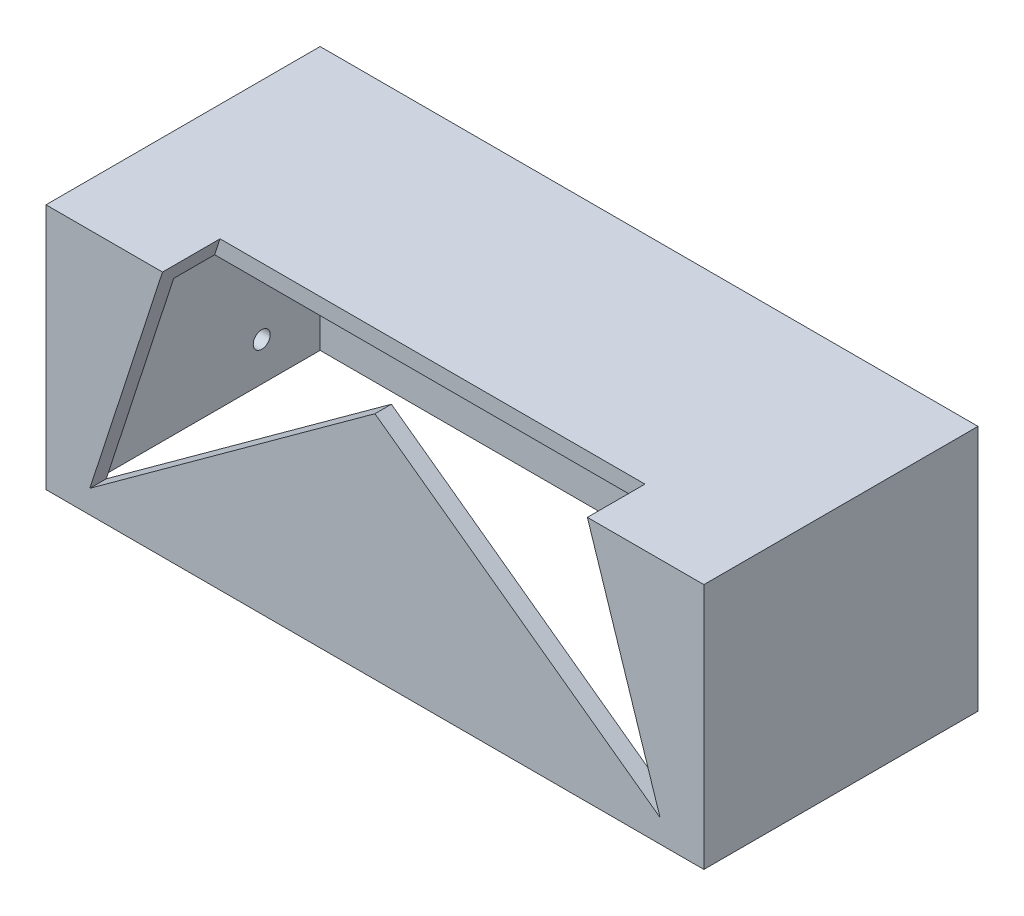
ISO-10303-21;
HEADER;
FILE_DESCRIPTION(('STEP AP214'),'2;1');
FILE_NAME('part.step','',(''),(''),'','','');
FILE_SCHEMA(('AUTOMOTIVE_DESIGN { 1 0 10303 214 1 1 1 1 }'));
ENDSEC;
DATA;
#1=APPLICATION_CONTEXT('core data for automotive mechanical design processes');
#2=APPLICATION_PROTOCOL_DEFINITION('international standard','automotive_design',2000,#1);
#3=PRODUCT_CONTEXT('',#1,'mechanical');
#4=PRODUCT('Part','Part','',(#3));
#5=PRODUCT_RELATED_PRODUCT_CATEGORY('part','',(#4));
#6=PRODUCT_DEFINITION_FORMATION('','',#4);
#7=PRODUCT_DEFINITION_CONTEXT('part definition',#1,'design');
#8=PRODUCT_DEFINITION('design','',#6,#7);
#9=PRODUCT_DEFINITION_SHAPE('','',#8);
#10=(LENGTH_UNIT() NAMED_UNIT(*) SI_UNIT(.MILLI.,.METRE.));
#11=(NAMED_UNIT(*) PLANE_ANGLE_UNIT() SI_UNIT($,.RADIAN.));
#12=(NAMED_UNIT(*) SI_UNIT($,.STERADIAN.) SOLID_ANGLE_UNIT());
#13=UNCERTAINTY_MEASURE_WITH_UNIT(LENGTH_MEASURE(1.E-05),#10,'distance_accuracy_value','');
#14=(GEOMETRIC_REPRESENTATION_CONTEXT(3) GLOBAL_UNCERTAINTY_ASSIGNED_CONTEXT((#13)) GLOBAL_UNIT_ASSIGNED_CONTEXT((#10,
#11,#12)) REPRESENTATION_CONTEXT('',''));
#15=CARTESIAN_POINT('',(0.,0.,0.));
#16=DIRECTION('',(0.,0.,1.));
#17=DIRECTION('',(1.,0.,0.));
#18=AXIS2_PLACEMENT_3D('',#15,#16,#17);
#19=CARTESIAN_POINT('',(-60.,-75.7889870078079,-7.00000000000001));
#20=DIRECTION('',(0.,1.,0.));
#21=DIRECTION('',(0.,0.,1.));
#22=AXIS2_PLACEMENT_3D('',#19,#20,#21);
#23=PLANE('',#22);
#24=DIRECTION('',(0.,0.,-1.));
#25=VECTOR('',#24,1.);
#26=CARTESIAN_POINT('',(-60.,-75.7889870078079,-7.00000000000001));
#27=LINE('',#26,#25);
#28=CARTESIAN_POINT('',(-60.,-75.7889870078079,-7.00000000000001));
#29=VERTEX_POINT('',#28);
#30=CARTESIAN_POINT('',(-60.,-75.7889870078079,-57.));
#31=VERTEX_POINT('',#30);
#32=EDGE_CURVE('E427',#29,#31,#27,.T.);
#33=ORIENTED_EDGE('',*,*,#32,.T.);
#34=DIRECTION('',(1.,0.,0.));
#35=VECTOR('',#34,1.);
#36=CARTESIAN_POINT('',(-60.,-75.7889870078079,-57.));
#37=LINE('',#36,#35);
#38=CARTESIAN_POINT('',(60.,-75.7889870078079,-57.));
#39=VERTEX_POINT('',#38);
#40=EDGE_CURVE('E315',#31,#39,#37,.T.);
#41=ORIENTED_EDGE('',*,*,#40,.T.);
#42=DIRECTION('',(0.,0.,-1.));
#43=VECTOR('',#42,1.);
#44=CARTESIAN_POINT('',(60.,-75.7889870078079,-7.00000000000001));
#45=LINE('',#44,#43);
#46=CARTESIAN_POINT('',(60.,-75.7889870078079,-7.00000000000001));
#47=VERTEX_POINT('',#46);
#48=EDGE_CURVE('E424',#47,#39,#45,.T.);
#49=ORIENTED_EDGE('',*,*,#48,.F.);
#50=DIRECTION('',(1.,0.,0.));
#51=VECTOR('',#50,1.);
#52=CARTESIAN_POINT('',(-60.,-75.7889870078079,-7.00000000000001));
#53=LINE('',#52,#51);
#54=EDGE_CURVE('E440',#29,#47,#53,.T.);
#55=ORIENTED_EDGE('',*,*,#54,.F.);
#56=EDGE_LOOP('',(#33,#41,#49,#55));
#57=FACE_BOUND('',#56,.T.);
#58=DIRECTION('',(0.,0.,-1.));
#59=VECTOR('',#58,1.);
#60=CARTESIAN_POINT('',(-57.,-75.7889870078079,-7.00000000000001));
#61=LINE('',#60,#59);
#62=CARTESIAN_POINT('',(-57.,-75.7889870078079,-10.));
#63=VERTEX_POINT('',#62);
#64=CARTESIAN_POINT('',(-57.,-75.7889870078079,-54.));
#65=VERTEX_POINT('',#64);
#66=EDGE_CURVE('E390',#63,#65,#61,.T.);
#67=ORIENTED_EDGE('',*,*,#66,.F.);
#68=DIRECTION('',(1.,0.,0.));
#69=VECTOR('',#68,1.);
#70=CARTESIAN_POINT('',(0.,-75.7889870078079,-10.));
#71=LINE('',#70,#69);
#72=CARTESIAN_POINT('',(57.,-75.7889870078079,-10.));
#73=VERTEX_POINT('',#72);
#74=EDGE_CURVE('E386',#63,#73,#71,.T.);
#75=ORIENTED_EDGE('',*,*,#74,.T.);
#76=DIRECTION('',(0.,0.,-1.));
#77=VECTOR('',#76,1.);
#78=CARTESIAN_POINT('',(57.,-75.7889870078079,-7.00000000000001));
#79=LINE('',#78,#77);
#80=CARTESIAN_POINT('',(57.,-75.7889870078079,-54.));
#81=VERTEX_POINT('',#80);
#82=EDGE_CURVE('E387',#73,#81,#79,.T.);
#83=ORIENTED_EDGE('',*,*,#82,.T.);
#84=DIRECTION('',(1.,0.,0.));
#85=VECTOR('',#84,1.);
#86=CARTESIAN_POINT('',(0.,-75.7889870078079,-54.));
#87=LINE('',#86,#85);
#88=EDGE_CURVE('E375',#65,#81,#87,.T.);
#89=ORIENTED_EDGE('',*,*,#88,.F.);
#90=EDGE_LOOP('',(#67,#75,#83,#89));
#91=FACE_BOUND('',#90,.T.);
#92=ADVANCED_FACE('F39',(#57,#91),#23,.F.);
#93=CARTESIAN_POINT('',(60.,-75.7889870078079,-7.00000000000001));
#94=DIRECTION('',(-1.,0.,0.));
#95=DIRECTION('',(0.,0.,1.));
#96=AXIS2_PLACEMENT_3D('',#93,#94,#95);
#97=PLANE('',#96);
#98=ORIENTED_EDGE('',*,*,#48,.T.);
#99=DIRECTION('',(0.,1.,0.));
#100=VECTOR('',#99,1.);
#101=CARTESIAN_POINT('',(60.,-75.7889870078079,-57.));
#102=LINE('',#101,#100);
#103=CARTESIAN_POINT('',(60.,-30.7889870078079,-57.));
#104=VERTEX_POINT('',#103);
#105=EDGE_CURVE('E396',#39,#104,#102,.T.);
#106=ORIENTED_EDGE('',*,*,#105,.T.);
#107=DIRECTION('',(0.,0.,-1.));
#108=VECTOR('',#107,1.);
#109=CARTESIAN_POINT('',(60.,-30.7889870078079,-7.00000000000001));
#110=LINE('',#109,#108);
#111=CARTESIAN_POINT('',(60.,-30.7889870078079,-7.00000000000001));
#112=VERTEX_POINT('',#111);
#113=EDGE_CURVE('E333',#112,#104,#110,.T.);
#114=ORIENTED_EDGE('',*,*,#113,.F.);
#115=DIRECTION('',(0.,1.,0.));
#116=VECTOR('',#115,1.);
#117=CARTESIAN_POINT('',(60.,-75.7889870078079,-7.00000000000001));
#118=LINE('',#117,#116);
#119=EDGE_CURVE('E307',#47,#112,#118,.T.);
#120=ORIENTED_EDGE('',*,*,#119,.F.);
#121=EDGE_LOOP('',(#98,#106,#114,#120));
#122=FACE_BOUND('',#121,.T.);
#123=ADVANCED_FACE('F41',(#122),#97,.F.);
#124=CARTESIAN_POINT('',(-60.,-30.7889870078079,-7.00000000000001));
#125=DIRECTION('',(0.,-1.,0.));
#126=DIRECTION('',(0.,0.,-1.));
#127=AXIS2_PLACEMENT_3D('',#124,#125,#126);
#128=PLANE('',#127);
#129=DIRECTION('',(-1.,0.,0.));
#130=VECTOR('',#129,1.);
#131=CARTESIAN_POINT('',(-60.,-30.7889870078079,-7.00000000000001));
#132=LINE('',#131,#130);
#133=CARTESIAN_POINT('',(-38.7498603935466,-30.7889870078079,-7.00000000000001));
#134=VERTEX_POINT('',#133);
#135=CARTESIAN_POINT('',(-60.,-30.7889870078079,-7.00000000000001));
#136=VERTEX_POINT('',#135);
#137=EDGE_CURVE('E297',#134,#136,#132,.T.);
#138=ORIENTED_EDGE('',*,*,#137,.F.);
#139=DIRECTION('',(0.,0.,-1.));
#140=VECTOR('',#139,1.);
#141=CARTESIAN_POINT('',(-38.7498603935466,-30.7889870078079,-7.00000000000001));
#142=LINE('',#141,#140);
#143=CARTESIAN_POINT('',(-38.7498603935466,-30.7889870078079,-17.5));
#144=VERTEX_POINT('',#143);
#145=EDGE_CURVE('E299',#134,#144,#142,.T.);
#146=ORIENTED_EDGE('',*,*,#145,.T.);
#147=DIRECTION('',(1.,0.,0.));
#148=VECTOR('',#147,1.);
#149=CARTESIAN_POINT('',(-60.,-30.7889870078079,-17.5));
#150=LINE('',#149,#148);
#151=CARTESIAN_POINT('',(38.7498603935466,-30.7889870078079,-17.5));
#152=VERTEX_POINT('',#151);
#153=EDGE_CURVE('E470',#144,#152,#150,.T.);
#154=ORIENTED_EDGE('',*,*,#153,.T.);
#155=DIRECTION('',(0.,0.,1.));
#156=VECTOR('',#155,1.);
#157=CARTESIAN_POINT('',(38.7498603935466,-30.7889870078079,-7.00000000000001));
#158=LINE('',#157,#156);
#159=CARTESIAN_POINT('',(38.7498603935466,-30.7889870078079,-7.00000000000001));
#160=VERTEX_POINT('',#159);
#161=EDGE_CURVE('E364',#152,#160,#158,.T.);
#162=ORIENTED_EDGE('',*,*,#161,.T.);
#163=EDGE_CURVE('E306',#112,#160,#132,.T.);
#164=ORIENTED_EDGE('',*,*,#163,.F.);
#165=ORIENTED_EDGE('',*,*,#113,.T.);
#166=DIRECTION('',(-1.,0.,0.));
#167=VECTOR('',#166,1.);
#168=CARTESIAN_POINT('',(-60.,-30.7889870078079,-57.));
#169=LINE('',#168,#167);
#170=CARTESIAN_POINT('',(-60.,-30.7889870078079,-57.));
#171=VERTEX_POINT('',#170);
#172=EDGE_CURVE('E400',#104,#171,#169,.T.);
#173=ORIENTED_EDGE('',*,*,#172,.T.);
#174=DIRECTION('',(0.,0.,-1.));
#175=VECTOR('',#174,1.);
#176=CARTESIAN_POINT('',(-60.,-30.7889870078079,-7.00000000000001));
#177=LINE('',#176,#175);
#178=EDGE_CURVE('E301',#136,#171,#177,.T.);
#179=ORIENTED_EDGE('',*,*,#178,.F.);
#180=EDGE_LOOP('',(#138,#146,#154,#162,#164,#165,#173,#179));
#181=FACE_BOUND('',#180,.T.);
#182=ADVANCED_FACE('F280',(#181),#128,.F.);
#183=CARTESIAN_POINT('',(-60.,-75.7889870078079,-7.00000000000001));
#184=DIRECTION('',(1.,0.,0.));
#185=DIRECTION('',(0.,0.,-1.));
#186=AXIS2_PLACEMENT_3D('',#183,#184,#185);
#187=PLANE('',#186);
#188=CARTESIAN_POINT('',(-60.,-37.7715931653233,-43.35));
#189=DIRECTION('',(-1.,0.,0.));
#190=DIRECTION('',(0.,0.,1.));
#191=AXIS2_PLACEMENT_3D('',#188,#189,#190);
#192=CIRCLE('',#191,1.55000000000001);
#193=CARTESIAN_POINT('',(-60.,-37.7715931653233,-41.8));
#194=VERTEX_POINT('',#193);
#195=EDGE_CURVE('E240',#194,#194,#192,.T.);
#196=ORIENTED_EDGE('',*,*,#195,.F.);
#197=EDGE_LOOP('',(#196));
#198=FACE_BOUND('',#197,.T.);
#199=CARTESIAN_POINT('',(-60.,-68.7368054803541,-43.35));
#200=DIRECTION('',(-1.,0.,0.));
#201=DIRECTION('',(0.,0.,1.));
#202=AXIS2_PLACEMENT_3D('',#199,#200,#201);
#203=CIRCLE('',#202,1.55000000000001);
#204=CARTESIAN_POINT('',(-60.,-68.7368054803541,-41.8));
#205=VERTEX_POINT('',#204);
#206=EDGE_CURVE('E249',#205,#205,#203,.T.);
#207=ORIENTED_EDGE('',*,*,#206,.F.);
#208=EDGE_LOOP('',(#207));
#209=FACE_BOUND('',#208,.T.);
#210=DIRECTION('',(0.,1.,0.));
#211=VECTOR('',#210,1.);
#212=CARTESIAN_POINT('',(-60.,-58.5041993228387,-44.5));
#213=LINE('',#212,#211);
#214=CARTESIAN_POINT('',(-60.,-58.5041993228387,-44.5));
#215=VERTEX_POINT('',#214);
#216=CARTESIAN_POINT('',(-60.,-48.0041993228387,-44.5));
#217=VERTEX_POINT('',#216);
#218=EDGE_CURVE('E184',#215,#217,#213,.T.);
#219=ORIENTED_EDGE('',*,*,#218,.F.);
#220=DIRECTION('',(0.,0.,1.));
#221=VECTOR('',#220,1.);
#222=CARTESIAN_POINT('',(-60.,-58.5041993228387,-52.5));
#223=LINE('',#222,#221);
#224=CARTESIAN_POINT('',(-60.,-58.5041993228387,-52.5));
#225=VERTEX_POINT('',#224);
#226=EDGE_CURVE('E205',#225,#215,#223,.T.);
#227=ORIENTED_EDGE('',*,*,#226,.F.);
#228=DIRECTION('',(0.,-1.,0.));
#229=VECTOR('',#228,1.);
#230=CARTESIAN_POINT('',(-60.,-58.5041993228387,-52.5));
#231=LINE('',#230,#229);
#232=CARTESIAN_POINT('',(-60.,-48.0041993228387,-52.5));
#233=VERTEX_POINT('',#232);
#234=EDGE_CURVE('E201',#233,#225,#231,.T.);
#235=ORIENTED_EDGE('',*,*,#234,.F.);
#236=DIRECTION('',(0.,0.,-1.));
#237=VECTOR('',#236,1.);
#238=CARTESIAN_POINT('',(-60.,-48.0041993228387,-52.5));
#239=LINE('',#238,#237);
#240=EDGE_CURVE('E54',#217,#233,#239,.T.);
#241=ORIENTED_EDGE('',*,*,#240,.F.);
#242=EDGE_LOOP('',(#219,#227,#235,#241));
#243=FACE_BOUND('',#242,.T.);
#244=ORIENTED_EDGE('',*,*,#178,.T.);
#245=DIRECTION('',(0.,-1.,0.));
#246=VECTOR('',#245,1.);
#247=CARTESIAN_POINT('',(-60.,-75.7889870078079,-57.));
#248=LINE('',#247,#246);
#249=EDGE_CURVE('E430',#171,#31,#248,.T.);
#250=ORIENTED_EDGE('',*,*,#249,.T.);
#251=ORIENTED_EDGE('',*,*,#32,.F.);
#252=DIRECTION('',(0.,-1.,0.));
#253=VECTOR('',#252,1.);
#254=CARTESIAN_POINT('',(-60.,-75.7889870078079,-7.00000000000001));
#255=LINE('',#254,#253);
#256=EDGE_CURVE('E312',#136,#29,#255,.T.);
#257=ORIENTED_EDGE('',*,*,#256,.F.);
#258=EDGE_LOOP('',(#244,#250,#251,#257));
#259=FACE_BOUND('',#258,.T.);
#260=ADVANCED_FACE('F287',(#198,#209,#243,#259),#187,.F.);
#261=CARTESIAN_POINT('',(0.,0.,-7.00000000000001));
#262=DIRECTION('',(0.,0.,-1.));
#263=DIRECTION('',(-1.,0.,0.));
#264=AXIS2_PLACEMENT_3D('',#261,#262,#263);
#265=PLANE('',#264);
#266=DIRECTION('',(0.809016994374948,0.587785252292473,0.));
#267=VECTOR('',#266,1.);
#268=CARTESIAN_POINT('',(-52.0018434853685,-71.5743972044329,-7.00000000000001));
#269=LINE('',#268,#267);
#270=CARTESIAN_POINT('',(-52.0018434853685,-71.5743972044329,-7.00000000000001));
#271=VERTEX_POINT('',#270);
#272=CARTESIAN_POINT('',(0.,-33.7928463776342,-7.00000000000001));
#273=VERTEX_POINT('',#272);
#274=EDGE_CURVE('E452',#271,#273,#269,.T.);
#275=ORIENTED_EDGE('',*,*,#274,.F.);
#276=DIRECTION('',(-0.309016994374947,-0.951056516295154,0.));
#277=VECTOR('',#276,1.);
#278=CARTESIAN_POINT('',(-32.13890675161,-10.4425638189908,-7.00000000000001));
#279=LINE('',#278,#277);
#280=EDGE_CURVE('E245',#134,#271,#279,.T.);
#281=ORIENTED_EDGE('',*,*,#280,.F.);
#282=ORIENTED_EDGE('',*,*,#137,.T.);
#283=ORIENTED_EDGE('',*,*,#256,.T.);
#284=ORIENTED_EDGE('',*,*,#54,.T.);
#285=ORIENTED_EDGE('',*,*,#119,.T.);
#286=ORIENTED_EDGE('',*,*,#163,.T.);
#287=DIRECTION('',(-0.309016994374947,0.951056516295154,0.));
#288=VECTOR('',#287,1.);
#289=CARTESIAN_POINT('',(52.0018434853685,-71.5743972044329,-7.00000000000001));
#290=LINE('',#289,#288);
#291=CARTESIAN_POINT('',(52.0018434853685,-71.5743972044329,-7.00000000000001));
#292=VERTEX_POINT('',#291);
#293=EDGE_CURVE('E224',#292,#160,#290,.T.);
#294=ORIENTED_EDGE('',*,*,#293,.F.);
#295=DIRECTION('',(0.809016994374947,-0.587785252292473,0.));
#296=VECTOR('',#295,1.);
#297=CARTESIAN_POINT('',(0.,-33.7928463776342,-7.00000000000001));
#298=LINE('',#297,#296);
#299=EDGE_CURVE('E229',#273,#292,#298,.T.);
#300=ORIENTED_EDGE('',*,*,#299,.F.);
#301=EDGE_LOOP('',(#275,#281,#282,#283,#284,#285,#286,#294,#300));
#302=FACE_BOUND('',#301,.T.);
#303=ADVANCED_FACE('F285',(#302),#265,.F.);
#304=CARTESIAN_POINT('',(0.,0.,-57.));
#305=DIRECTION('',(0.,0.,-1.));
#306=DIRECTION('',(-1.,0.,0.));
#307=AXIS2_PLACEMENT_3D('',#304,#305,#306);
#308=PLANE('',#307);
#309=CARTESIAN_POINT('',(-7.61739384248457,-53.2541993228387,-57.));
#310=DIRECTION('',(0.,0.,-1.));
#311=DIRECTION('',(-1.,0.,0.));
#312=AXIS2_PLACEMENT_3D('',#309,#310,#311);
#313=CIRCLE('',#312,1.54999999999999);
#314=CARTESIAN_POINT('',(-9.16739384248456,-53.2541993228387,-57.));
#315=VERTEX_POINT('',#314);
#316=EDGE_CURVE('E194',#315,#315,#313,.T.);
#317=ORIENTED_EDGE('',*,*,#316,.F.);
#318=EDGE_LOOP('',(#317));
#319=FACE_BOUND('',#318,.T.);
#320=ORIENTED_EDGE('',*,*,#105,.F.);
#321=ORIENTED_EDGE('',*,*,#40,.F.);
#322=ORIENTED_EDGE('',*,*,#249,.F.);
#323=ORIENTED_EDGE('',*,*,#172,.F.);
#324=EDGE_LOOP('',(#320,#321,#322,#323));
#325=FACE_BOUND('',#324,.T.);
#326=ADVANCED_FACE('F412',(#319,#325),#308,.T.);
#327=CARTESIAN_POINT('',(57.,-75.7889870078079,-7.00000000000001));
#328=DIRECTION('',(-1.,0.,0.));
#329=DIRECTION('',(0.,0.,1.));
#330=AXIS2_PLACEMENT_3D('',#327,#328,#329);
#331=PLANE('',#330);
#332=ORIENTED_EDGE('',*,*,#82,.F.);
#333=DIRECTION('',(0.,1.,0.));
#334=VECTOR('',#333,1.);
#335=CARTESIAN_POINT('',(57.,0.,-10.));
#336=LINE('',#335,#334);
#337=CARTESIAN_POINT('',(57.,-33.7889870078079,-10.));
#338=VERTEX_POINT('',#337);
#339=EDGE_CURVE('E371',#73,#338,#336,.T.);
#340=ORIENTED_EDGE('',*,*,#339,.T.);
#341=DIRECTION('',(0.,0.,-1.));
#342=VECTOR('',#341,1.);
#343=CARTESIAN_POINT('',(57.,-33.7889870078079,-7.00000000000001));
#344=LINE('',#343,#342);
#345=CARTESIAN_POINT('',(57.,-33.7889870078079,-54.));
#346=VERTEX_POINT('',#345);
#347=EDGE_CURVE('E401',#338,#346,#344,.T.);
#348=ORIENTED_EDGE('',*,*,#347,.T.);
#349=DIRECTION('',(0.,1.,0.));
#350=VECTOR('',#349,1.);
#351=CARTESIAN_POINT('',(57.,0.,-54.));
#352=LINE('',#351,#350);
#353=EDGE_CURVE('E474',#81,#346,#352,.T.);
#354=ORIENTED_EDGE('',*,*,#353,.F.);
#355=EDGE_LOOP('',(#332,#340,#348,#354));
#356=FACE_BOUND('',#355,.T.);
#357=ADVANCED_FACE('F415',(#356),#331,.T.);
#358=CARTESIAN_POINT('',(-60.,-33.7889870078079,-7.00000000000001));
#359=DIRECTION('',(0.,-1.,0.));
#360=DIRECTION('',(0.,0.,-1.));
#361=AXIS2_PLACEMENT_3D('',#358,#359,#360);
#362=PLANE('',#361);
#363=DIRECTION('',(0.,0.,-1.));
#364=VECTOR('',#363,1.);
#365=CARTESIAN_POINT('',(-39.7246194822454,-33.7889870078079,-7.00000000000001));
#366=LINE('',#365,#364);
#367=CARTESIAN_POINT('',(-39.7246194822454,-33.7889870078079,-10.));
#368=VERTEX_POINT('',#367);
#369=CARTESIAN_POINT('',(-39.7246194822454,-33.7889870078079,-17.5));
#370=VERTEX_POINT('',#369);
#371=EDGE_CURVE('E351',#368,#370,#366,.T.);
#372=ORIENTED_EDGE('',*,*,#371,.F.);
#373=DIRECTION('',(-1.,0.,0.));
#374=VECTOR('',#373,1.);
#375=CARTESIAN_POINT('',(0.,-33.7889870078079,-10.));
#376=LINE('',#375,#374);
#377=CARTESIAN_POINT('',(-57.,-33.7889870078079,-10.));
#378=VERTEX_POINT('',#377);
#379=EDGE_CURVE('E361',#368,#378,#376,.T.);
#380=ORIENTED_EDGE('',*,*,#379,.T.);
#381=DIRECTION('',(0.,0.,-1.));
#382=VECTOR('',#381,1.);
#383=CARTESIAN_POINT('',(-57.,-33.7889870078079,-7.00000000000001));
#384=LINE('',#383,#382);
#385=CARTESIAN_POINT('',(-57.,-33.7889870078079,-54.));
#386=VERTEX_POINT('',#385);
#387=EDGE_CURVE('E379',#378,#386,#384,.T.);
#388=ORIENTED_EDGE('',*,*,#387,.T.);
#389=DIRECTION('',(-1.,0.,0.));
#390=VECTOR('',#389,1.);
#391=CARTESIAN_POINT('',(0.,-33.7889870078079,-54.));
#392=LINE('',#391,#390);
#393=EDGE_CURVE('E384',#346,#386,#392,.T.);
#394=ORIENTED_EDGE('',*,*,#393,.F.);
#395=ORIENTED_EDGE('',*,*,#347,.F.);
#396=CARTESIAN_POINT('',(39.7246194822454,-33.7889870078079,-10.));
#397=VERTEX_POINT('',#396);
#398=EDGE_CURVE('E370',#338,#397,#376,.T.);
#399=ORIENTED_EDGE('',*,*,#398,.T.);
#400=DIRECTION('',(0.,0.,1.));
#401=VECTOR('',#400,1.);
#402=CARTESIAN_POINT('',(39.7246194822454,-33.7889870078079,-7.00000000000001));
#403=LINE('',#402,#401);
#404=CARTESIAN_POINT('',(39.7246194822454,-33.7889870078079,-17.5));
#405=VERTEX_POINT('',#404);
#406=EDGE_CURVE('E457',#405,#397,#403,.T.);
#407=ORIENTED_EDGE('',*,*,#406,.F.);
#408=DIRECTION('',(1.,0.,0.));
#409=VECTOR('',#408,1.);
#410=CARTESIAN_POINT('',(-60.,-33.7889870078079,-17.5));
#411=LINE('',#410,#409);
#412=EDGE_CURVE('E12',#370,#405,#411,.T.);
#413=ORIENTED_EDGE('',*,*,#412,.F.);
#414=EDGE_LOOP('',(#372,#380,#388,#394,#395,#399,#407,#413));
#415=FACE_BOUND('',#414,.T.);
#416=ADVANCED_FACE('F360',(#415),#362,.T.);
#417=CARTESIAN_POINT('',(-57.,-75.7889870078079,-7.00000000000001));
#418=DIRECTION('',(1.,0.,0.));
#419=DIRECTION('',(0.,0.,-1.));
#420=AXIS2_PLACEMENT_3D('',#417,#418,#419);
#421=PLANE('',#420);
#422=CARTESIAN_POINT('',(-57.,-37.7715931653233,-43.35));
#423=DIRECTION('',(1.,0.,0.));
#424=DIRECTION('',(0.,0.,-1.));
#425=AXIS2_PLACEMENT_3D('',#422,#423,#424);
#426=CIRCLE('',#425,1.55000000000001);
#427=CARTESIAN_POINT('',(-57.,-37.7715931653233,-44.9));
#428=VERTEX_POINT('',#427);
#429=EDGE_CURVE('E246',#428,#428,#426,.F.);
#430=ORIENTED_EDGE('',*,*,#429,.T.);
#431=EDGE_LOOP('',(#430));
#432=FACE_BOUND('',#431,.T.);
#433=CARTESIAN_POINT('',(-57.,-68.7368054803541,-43.35));
#434=DIRECTION('',(1.,0.,0.));
#435=DIRECTION('',(0.,0.,-1.));
#436=AXIS2_PLACEMENT_3D('',#433,#434,#435);
#437=CIRCLE('',#436,1.55000000000001);
#438=CARTESIAN_POINT('',(-57.,-68.7368054803541,-44.9));
#439=VERTEX_POINT('',#438);
#440=EDGE_CURVE('E197',#439,#439,#437,.F.);
#441=ORIENTED_EDGE('',*,*,#440,.T.);
#442=EDGE_LOOP('',(#441));
#443=FACE_BOUND('',#442,.T.);
#444=DIRECTION('',(0.,0.,1.));
#445=VECTOR('',#444,1.);
#446=CARTESIAN_POINT('',(-57.,-58.5041993228387,-52.5));
#447=LINE('',#446,#445);
#448=CARTESIAN_POINT('',(-57.,-58.5041993228387,-52.5));
#449=VERTEX_POINT('',#448);
#450=CARTESIAN_POINT('',(-57.,-58.5041993228387,-44.5));
#451=VERTEX_POINT('',#450);
#452=EDGE_CURVE('E190',#449,#451,#447,.T.);
#453=ORIENTED_EDGE('',*,*,#452,.T.);
#454=DIRECTION('',(0.,1.,0.));
#455=VECTOR('',#454,1.);
#456=CARTESIAN_POINT('',(-57.,-58.5041993228387,-44.5));
#457=LINE('',#456,#455);
#458=CARTESIAN_POINT('',(-57.,-48.0041993228387,-44.5));
#459=VERTEX_POINT('',#458);
#460=EDGE_CURVE('E178',#451,#459,#457,.T.);
#461=ORIENTED_EDGE('',*,*,#460,.T.);
#462=DIRECTION('',(0.,0.,-1.));
#463=VECTOR('',#462,1.);
#464=CARTESIAN_POINT('',(-57.,-48.0041993228387,-52.5));
#465=LINE('',#464,#463);
#466=CARTESIAN_POINT('',(-57.,-48.0041993228387,-52.5));
#467=VERTEX_POINT('',#466);
#468=EDGE_CURVE('E168',#459,#467,#465,.T.);
#469=ORIENTED_EDGE('',*,*,#468,.T.);
#470=DIRECTION('',(0.,-1.,0.));
#471=VECTOR('',#470,1.);
#472=CARTESIAN_POINT('',(-57.,-58.5041993228387,-52.5));
#473=LINE('',#472,#471);
#474=EDGE_CURVE('E177',#467,#449,#473,.T.);
#475=ORIENTED_EDGE('',*,*,#474,.T.);
#476=EDGE_LOOP('',(#453,#461,#469,#475));
#477=FACE_BOUND('',#476,.T.);
#478=ORIENTED_EDGE('',*,*,#387,.F.);
#479=DIRECTION('',(0.,-1.,0.));
#480=VECTOR('',#479,1.);
#481=CARTESIAN_POINT('',(-57.,0.,-10.));
#482=LINE('',#481,#480);
#483=EDGE_CURVE('E369',#378,#63,#482,.T.);
#484=ORIENTED_EDGE('',*,*,#483,.T.);
#485=ORIENTED_EDGE('',*,*,#66,.T.);
#486=DIRECTION('',(0.,-1.,0.));
#487=VECTOR('',#486,1.);
#488=CARTESIAN_POINT('',(-57.,0.,-54.));
#489=LINE('',#488,#487);
#490=EDGE_CURVE('E381',#386,#65,#489,.T.);
#491=ORIENTED_EDGE('',*,*,#490,.F.);
#492=EDGE_LOOP('',(#478,#484,#485,#491));
#493=FACE_BOUND('',#492,.T.);
#494=ADVANCED_FACE('F188',(#432,#443,#477,#493),#421,.T.);
#495=CARTESIAN_POINT('',(0.,0.,-10.));
#496=DIRECTION('',(0.,0.,-1.));
#497=DIRECTION('',(-1.,0.,0.));
#498=AXIS2_PLACEMENT_3D('',#495,#496,#497);
#499=PLANE('',#498);
#500=DIRECTION('',(0.309016994374947,0.951056516295154,0.));
#501=VECTOR('',#500,1.);
#502=CARTESIAN_POINT('',(-26.0009217426843,8.44821159440853,-10.));
#503=LINE('',#502,#501);
#504=CARTESIAN_POINT('',(-52.0018434853685,-71.5743972044329,-10.));
#505=VERTEX_POINT('',#504);
#506=EDGE_CURVE('E47',#505,#368,#503,.T.);
#507=ORIENTED_EDGE('',*,*,#506,.F.);
#508=DIRECTION('',(-0.809016994374948,-0.587785252292473,0.));
#509=VECTOR('',#508,1.);
#510=CARTESIAN_POINT('',(16.069453375805,-22.1177050983125,-10.));
#511=LINE('',#510,#509);
#512=CARTESIAN_POINT('',(0.,-33.7928463776342,-10.));
#513=VERTEX_POINT('',#512);
#514=EDGE_CURVE('E344',#513,#505,#511,.T.);
#515=ORIENTED_EDGE('',*,*,#514,.F.);
#516=DIRECTION('',(-0.809016994374948,0.587785252292473,0.));
#517=VECTOR('',#516,1.);
#518=CARTESIAN_POINT('',(-16.069453375805,-22.1177050983125,-10.));
#519=LINE('',#518,#517);
#520=CARTESIAN_POINT('',(52.0018434853685,-71.5743972044329,-10.));
#521=VERTEX_POINT('',#520);
#522=EDGE_CURVE('E342',#521,#513,#519,.T.);
#523=ORIENTED_EDGE('',*,*,#522,.F.);
#524=DIRECTION('',(0.309016994374947,-0.951056516295154,0.));
#525=VECTOR('',#524,1.);
#526=CARTESIAN_POINT('',(26.0009217426843,8.44821159440853,-10.));
#527=LINE('',#526,#525);
#528=EDGE_CURVE('E338',#397,#521,#527,.T.);
#529=ORIENTED_EDGE('',*,*,#528,.F.);
#530=ORIENTED_EDGE('',*,*,#398,.F.);
#531=ORIENTED_EDGE('',*,*,#339,.F.);
#532=ORIENTED_EDGE('',*,*,#74,.F.);
#533=ORIENTED_EDGE('',*,*,#483,.F.);
#534=ORIENTED_EDGE('',*,*,#379,.F.);
#535=EDGE_LOOP('',(#507,#515,#523,#529,#530,#531,#532,#533,#534));
#536=FACE_BOUND('',#535,.T.);
#537=ADVANCED_FACE('F367',(#536),#499,.T.);
#538=CARTESIAN_POINT('',(0.,0.,-54.));
#539=DIRECTION('',(0.,0.,-1.));
#540=DIRECTION('',(-1.,0.,0.));
#541=AXIS2_PLACEMENT_3D('',#538,#539,#540);
#542=PLANE('',#541);
#543=CARTESIAN_POINT('',(-7.61739384248457,-53.2541993228387,-54.));
#544=DIRECTION('',(0.,0.,-1.));
#545=DIRECTION('',(-1.,0.,0.));
#546=AXIS2_PLACEMENT_3D('',#543,#544,#545);
#547=CIRCLE('',#546,1.54999999999999);
#548=CARTESIAN_POINT('',(-9.16739384248456,-53.2541993228387,-54.));
#549=VERTEX_POINT('',#548);
#550=EDGE_CURVE('E191',#549,#549,#547,.F.);
#551=ORIENTED_EDGE('',*,*,#550,.F.);
#552=EDGE_LOOP('',(#551));
#553=FACE_BOUND('',#552,.T.);
#554=ORIENTED_EDGE('',*,*,#353,.T.);
#555=ORIENTED_EDGE('',*,*,#393,.T.);
#556=ORIENTED_EDGE('',*,*,#490,.T.);
#557=ORIENTED_EDGE('',*,*,#88,.T.);
#558=EDGE_LOOP('',(#554,#555,#556,#557));
#559=FACE_BOUND('',#558,.T.);
#560=ADVANCED_FACE('F480',(#553,#559),#542,.F.);
#561=CARTESIAN_POINT('',(0.,0.,-17.5));
#562=DIRECTION('',(0.,0.,-1.));
#563=DIRECTION('',(-1.,0.,0.));
#564=AXIS2_PLACEMENT_3D('',#561,#562,#563);
#565=PLANE('',#564);
#566=DIRECTION('',(-0.309016994374947,-0.951056516295154,0.));
#567=VECTOR('',#566,1.);
#568=CARTESIAN_POINT('',(-32.13890675161,-10.4425638189908,-17.5));
#569=LINE('',#568,#567);
#570=EDGE_CURVE('E228',#144,#370,#569,.T.);
#571=ORIENTED_EDGE('',*,*,#570,.T.);
#572=ORIENTED_EDGE('',*,*,#412,.T.);
#573=DIRECTION('',(-0.309016994374947,0.951056516295154,0.));
#574=VECTOR('',#573,1.);
#575=CARTESIAN_POINT('',(52.0018434853685,-71.5743972044329,-17.5));
#576=LINE('',#575,#574);
#577=EDGE_CURVE('E454',#405,#152,#576,.T.);
#578=ORIENTED_EDGE('',*,*,#577,.T.);
#579=ORIENTED_EDGE('',*,*,#153,.F.);
#580=EDGE_LOOP('',(#571,#572,#578,#579));
#581=FACE_BOUND('',#580,.T.);
#582=ADVANCED_FACE('F494',(#581),#565,.F.);
#583=CARTESIAN_POINT('',(-32.13890675161,-10.4425638189908,-249.735085802417));
#584=DIRECTION('',(-0.951056516295154,0.309016994374947,0.));
#585=DIRECTION('',(-0.309016994374947,-0.951056516295154,0.));
#586=AXIS2_PLACEMENT_3D('',#583,#584,#585);
#587=PLANE('',#586);
#588=ORIENTED_EDGE('',*,*,#280,.T.);
#589=DIRECTION('',(0.,0.,1.));
#590=VECTOR('',#589,1.);
#591=CARTESIAN_POINT('',(-52.0018434853685,-71.5743972044329,-249.735085802417));
#592=LINE('',#591,#590);
#593=EDGE_CURVE('E354',#505,#271,#592,.T.);
#594=ORIENTED_EDGE('',*,*,#593,.F.);
#595=ORIENTED_EDGE('',*,*,#506,.T.);
#596=ORIENTED_EDGE('',*,*,#371,.T.);
#597=ORIENTED_EDGE('',*,*,#570,.F.);
#598=ORIENTED_EDGE('',*,*,#145,.F.);
#599=EDGE_LOOP('',(#588,#594,#595,#596,#597,#598));
#600=FACE_BOUND('',#599,.T.);
#601=ADVANCED_FACE('F349',(#600),#587,.F.);
#602=CARTESIAN_POINT('',(52.0018434853685,-71.5743972044329,-249.735085802417));
#603=DIRECTION('',(0.951056516295154,0.309016994374947,0.));
#604=DIRECTION('',(-0.309016994374947,0.951056516295154,0.));
#605=AXIS2_PLACEMENT_3D('',#602,#603,#604);
#606=PLANE('',#605);
#607=ORIENTED_EDGE('',*,*,#577,.F.);
#608=ORIENTED_EDGE('',*,*,#406,.T.);
#609=ORIENTED_EDGE('',*,*,#528,.T.);
#610=DIRECTION('',(0.,0.,1.));
#611=VECTOR('',#610,1.);
#612=CARTESIAN_POINT('',(52.0018434853685,-71.5743972044329,-249.735085802417));
#613=LINE('',#612,#611);
#614=EDGE_CURVE('E458',#521,#292,#613,.T.);
#615=ORIENTED_EDGE('',*,*,#614,.T.);
#616=ORIENTED_EDGE('',*,*,#293,.T.);
#617=ORIENTED_EDGE('',*,*,#161,.F.);
#618=EDGE_LOOP('',(#607,#608,#609,#615,#616,#617));
#619=FACE_BOUND('',#618,.T.);
#620=ADVANCED_FACE('F491',(#619),#606,.F.);
#621=CARTESIAN_POINT('',(-52.0018434853685,-71.5743972044329,-249.735085802417));
#622=DIRECTION('',(0.587785252292473,-0.809016994374947,0.));
#623=DIRECTION('',(0.809016994374948,0.587785252292473,0.));
#624=AXIS2_PLACEMENT_3D('',#621,#622,#623);
#625=PLANE('',#624);
#626=ORIENTED_EDGE('',*,*,#514,.T.);
#627=ORIENTED_EDGE('',*,*,#593,.T.);
#628=ORIENTED_EDGE('',*,*,#274,.T.);
#629=DIRECTION('',(0.,0.,1.));
#630=VECTOR('',#629,1.);
#631=CARTESIAN_POINT('',(0.,-33.7928463776342,-249.735085802417));
#632=LINE('',#631,#630);
#633=EDGE_CURVE('E462',#513,#273,#632,.T.);
#634=ORIENTED_EDGE('',*,*,#633,.F.);
#635=EDGE_LOOP('',(#626,#627,#628,#634));
#636=FACE_BOUND('',#635,.T.);
#637=ADVANCED_FACE('F503',(#636),#625,.F.);
#638=CARTESIAN_POINT('',(0.,-33.7928463776342,-249.735085802417));
#639=DIRECTION('',(-0.587785252292473,-0.809016994374947,0.));
#640=DIRECTION('',(0.809016994374948,-0.587785252292473,0.));
#641=AXIS2_PLACEMENT_3D('',#638,#639,#640);
#642=PLANE('',#641);
#643=ORIENTED_EDGE('',*,*,#522,.T.);
#644=ORIENTED_EDGE('',*,*,#633,.T.);
#645=ORIENTED_EDGE('',*,*,#299,.T.);
#646=ORIENTED_EDGE('',*,*,#614,.F.);
#647=EDGE_LOOP('',(#643,#644,#645,#646));
#648=FACE_BOUND('',#647,.T.);
#649=ADVANCED_FACE('F502',(#648),#642,.F.);
#650=CARTESIAN_POINT('',(60.001,-58.5041993228387,-52.5));
#651=DIRECTION('',(0.,-1.,0.));
#652=DIRECTION('',(0.,0.,-1.));
#653=AXIS2_PLACEMENT_3D('',#650,#651,#652);
#654=PLANE('',#653);
#655=DIRECTION('',(-1.,0.,0.));
#656=VECTOR('',#655,1.);
#657=CARTESIAN_POINT('',(60.001,-58.5041993228387,-52.5));
#658=LINE('',#657,#656);
#659=EDGE_CURVE('E62',#449,#225,#658,.T.);
#660=ORIENTED_EDGE('',*,*,#659,.T.);
#661=ORIENTED_EDGE('',*,*,#226,.T.);
#662=DIRECTION('',(-1.,0.,0.));
#663=VECTOR('',#662,1.);
#664=CARTESIAN_POINT('',(60.001,-58.5041993228387,-44.5));
#665=LINE('',#664,#663);
#666=EDGE_CURVE('E185',#451,#215,#665,.T.);
#667=ORIENTED_EDGE('',*,*,#666,.F.);
#668=ORIENTED_EDGE('',*,*,#452,.F.);
#669=EDGE_LOOP('',(#660,#661,#667,#668));
#670=FACE_BOUND('',#669,.T.);
#671=ADVANCED_FACE('F510',(#670),#654,.F.);
#672=CARTESIAN_POINT('',(60.001,-58.5041993228387,-44.5));
#673=DIRECTION('',(0.,0.,1.));
#674=DIRECTION('',(1.,0.,0.));
#675=AXIS2_PLACEMENT_3D('',#672,#673,#674);
#676=PLANE('',#675);
#677=ORIENTED_EDGE('',*,*,#666,.T.);
#678=ORIENTED_EDGE('',*,*,#218,.T.);
#679=DIRECTION('',(-1.,0.,0.));
#680=VECTOR('',#679,1.);
#681=CARTESIAN_POINT('',(60.001,-48.0041993228387,-44.5));
#682=LINE('',#681,#680);
#683=EDGE_CURVE('E171',#459,#217,#682,.T.);
#684=ORIENTED_EDGE('',*,*,#683,.F.);
#685=ORIENTED_EDGE('',*,*,#460,.F.);
#686=EDGE_LOOP('',(#677,#678,#684,#685));
#687=FACE_BOUND('',#686,.T.);
#688=ADVANCED_FACE('F181',(#687),#676,.F.);
#689=CARTESIAN_POINT('',(60.001,-48.0041993228387,-52.5));
#690=DIRECTION('',(0.,1.,0.));
#691=DIRECTION('',(0.,0.,1.));
#692=AXIS2_PLACEMENT_3D('',#689,#690,#691);
#693=PLANE('',#692);
#694=ORIENTED_EDGE('',*,*,#683,.T.);
#695=ORIENTED_EDGE('',*,*,#240,.T.);
#696=DIRECTION('',(-1.,0.,0.));
#697=VECTOR('',#696,1.);
#698=CARTESIAN_POINT('',(60.001,-48.0041993228387,-52.5));
#699=LINE('',#698,#697);
#700=EDGE_CURVE('E173',#467,#233,#699,.T.);
#701=ORIENTED_EDGE('',*,*,#700,.F.);
#702=ORIENTED_EDGE('',*,*,#468,.F.);
#703=EDGE_LOOP('',(#694,#695,#701,#702));
#704=FACE_BOUND('',#703,.T.);
#705=ADVANCED_FACE('F170',(#704),#693,.F.);
#706=CARTESIAN_POINT('',(60.001,-58.5041993228387,-52.5));
#707=DIRECTION('',(0.,0.,-1.));
#708=DIRECTION('',(-1.,0.,0.));
#709=AXIS2_PLACEMENT_3D('',#706,#707,#708);
#710=PLANE('',#709);
#711=ORIENTED_EDGE('',*,*,#700,.T.);
#712=ORIENTED_EDGE('',*,*,#234,.T.);
#713=ORIENTED_EDGE('',*,*,#659,.F.);
#714=ORIENTED_EDGE('',*,*,#474,.F.);
#715=EDGE_LOOP('',(#711,#712,#713,#714));
#716=FACE_BOUND('',#715,.T.);
#717=ADVANCED_FACE('F263',(#716),#710,.F.);
#718=CARTESIAN_POINT('',(60.001,-68.7368054803541,-43.35));
#719=DIRECTION('',(-1.,0.,0.));
#720=DIRECTION('',(0.,0.,1.));
#721=AXIS2_PLACEMENT_3D('',#718,#719,#720);
#722=CYLINDRICAL_SURFACE('',#721,1.55000000000001);
#723=ORIENTED_EDGE('',*,*,#440,.F.);
#724=EDGE_LOOP('',(#723));
#725=FACE_BOUND('',#724,.T.);
#726=ORIENTED_EDGE('',*,*,#206,.T.);
#727=EDGE_LOOP('',(#726));
#728=FACE_BOUND('',#727,.T.);
#729=ADVANCED_FACE('F260',(#725,#728),#722,.F.);
#730=CARTESIAN_POINT('',(60.001,-37.7715931653233,-43.35));
#731=DIRECTION('',(-1.,0.,0.));
#732=DIRECTION('',(0.,0.,1.));
#733=AXIS2_PLACEMENT_3D('',#730,#731,#732);
#734=CYLINDRICAL_SURFACE('',#733,1.55000000000001);
#735=ORIENTED_EDGE('',*,*,#429,.F.);
#736=EDGE_LOOP('',(#735));
#737=FACE_BOUND('',#736,.T.);
#738=ORIENTED_EDGE('',*,*,#195,.T.);
#739=EDGE_LOOP('',(#738));
#740=FACE_BOUND('',#739,.T.);
#741=ADVANCED_FACE('F262',(#737,#740),#734,.F.);
#742=CARTESIAN_POINT('',(-7.61739384248457,-53.2541993228387,-6.99900000000001));
#743=DIRECTION('',(0.,0.,-1.));
#744=DIRECTION('',(-1.,0.,0.));
#745=AXIS2_PLACEMENT_3D('',#742,#743,#744);
#746=CYLINDRICAL_SURFACE('',#745,1.54999999999999);
#747=ORIENTED_EDGE('',*,*,#316,.T.);
#748=EDGE_LOOP('',(#747));
#749=FACE_BOUND('',#748,.T.);
#750=ORIENTED_EDGE('',*,*,#550,.T.);
#751=EDGE_LOOP('',(#750));
#752=FACE_BOUND('',#751,.T.);
#753=ADVANCED_FACE('F269',(#749,#752),#746,.F.);
#754=CLOSED_SHELL('',(#92,#123,#182,#260,#303,#326,#357,#416,#494,#537,#560,#582,#601,#620,#637,
#649,#671,#688,#705,#717,#729,#741,#753));
#755=MANIFOLD_SOLID_BREP('B2',#754);
#756=ADVANCED_BREP_SHAPE_REPRESENTATION('',(#18,#755),#14);
#757=SHAPE_DEFINITION_REPRESENTATION(#9,#756);
ENDSEC;
END-ISO-10303-21;
